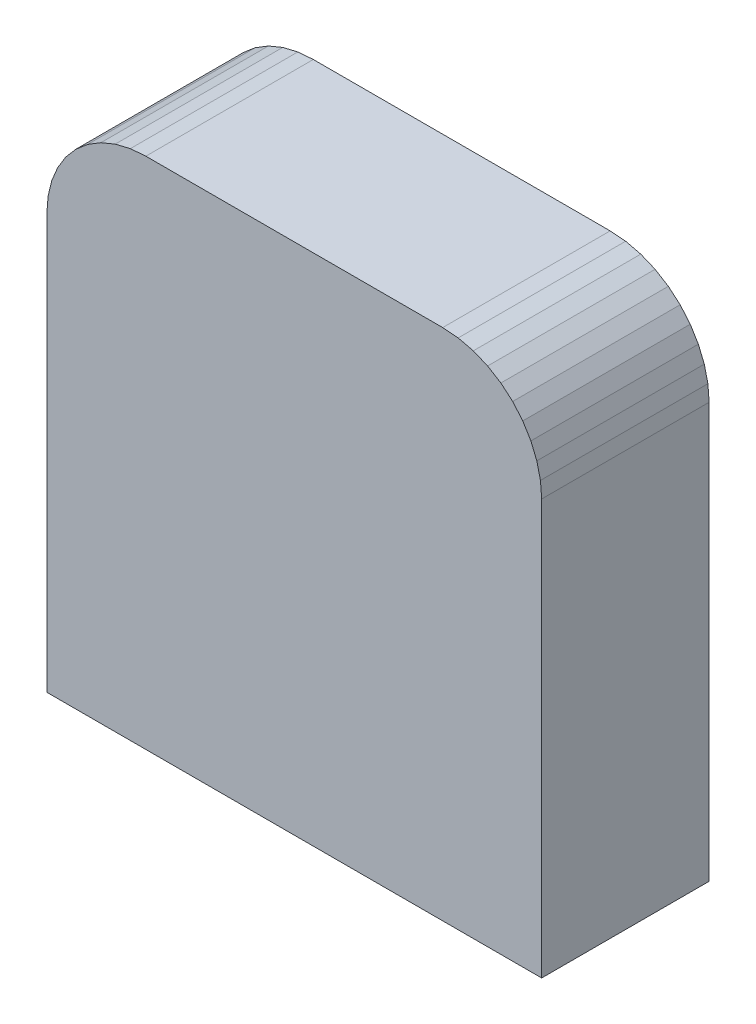
ISO-10303-21;
HEADER;
FILE_DESCRIPTION(('STEP AP214'),'2;1');
FILE_NAME('part.step','',(''),(''),'','','');
FILE_SCHEMA(('AUTOMOTIVE_DESIGN { 1 0 10303 214 1 1 1 1 }'));
ENDSEC;
DATA;
#1=APPLICATION_CONTEXT('core data for automotive mechanical design processes');
#2=APPLICATION_PROTOCOL_DEFINITION('international standard','automotive_design',2000,#1);
#3=PRODUCT_CONTEXT('',#1,'mechanical');
#4=PRODUCT('Part','Part','',(#3));
#5=PRODUCT_RELATED_PRODUCT_CATEGORY('part','',(#4));
#6=PRODUCT_DEFINITION_FORMATION('','',#4);
#7=PRODUCT_DEFINITION_CONTEXT('part definition',#1,'design');
#8=PRODUCT_DEFINITION('design','',#6,#7);
#9=PRODUCT_DEFINITION_SHAPE('','',#8);
#10=(LENGTH_UNIT() NAMED_UNIT(*) SI_UNIT(.MILLI.,.METRE.));
#11=(NAMED_UNIT(*) PLANE_ANGLE_UNIT() SI_UNIT($,.RADIAN.));
#12=(NAMED_UNIT(*) SI_UNIT($,.STERADIAN.) SOLID_ANGLE_UNIT());
#13=UNCERTAINTY_MEASURE_WITH_UNIT(LENGTH_MEASURE(1.E-05),#10,'distance_accuracy_value','');
#14=(GEOMETRIC_REPRESENTATION_CONTEXT(3) GLOBAL_UNCERTAINTY_ASSIGNED_CONTEXT((#13)) GLOBAL_UNIT_ASSIGNED_CONTEXT((#10,
#11,#12)) REPRESENTATION_CONTEXT('',''));
#15=CARTESIAN_POINT('',(0.,0.,0.));
#16=DIRECTION('',(0.,0.,1.));
#17=DIRECTION('',(1.,0.,0.));
#18=AXIS2_PLACEMENT_3D('',#15,#16,#17);
#19=CARTESIAN_POINT('',(2.04827694892883,22.9141213819385,5.69999957084656));
#20=DIRECTION('',(-0.76040506217341,0.649449106105362,0.));
#21=DIRECTION('',(-0.649449106105362,-0.76040506217341,0.));
#22=AXIS2_PLACEMENT_3D('',#19,#20,#21);
#23=PLANE('',#22);
#24=DIRECTION('',(0.,0.,1.));
#25=VECTOR('',#24,1.);
#26=CARTESIAN_POINT('',(2.18076019287109,23.0692388936877,5.69999957084656));
#27=LINE('',#26,#25);
#28=CARTESIAN_POINT('',(2.18076019287107,23.0692388936877,5.69999957084656));
#29=VERTEX_POINT('',#28);
#30=CARTESIAN_POINT('',(2.18076019287107,23.0692388936877,7.89999985694885));
#31=VERTEX_POINT('',#30);
#32=EDGE_CURVE('E181',#29,#31,#27,.T.);
#33=ORIENTED_EDGE('',*,*,#32,.F.);
#34=DIRECTION('',(-0.649449106105362,-0.76040506217341,0.));
#35=VECTOR('',#34,1.);
#36=CARTESIAN_POINT('',(2.04827694892883,22.9141213819385,5.69999957084656));
#37=LINE('',#36,#35);
#38=CARTESIAN_POINT('',(2.04827694892883,22.9141213819385,5.69999957084656));
#39=VERTEX_POINT('',#38);
#40=EDGE_CURVE('E174',#29,#39,#37,.T.);
#41=ORIENTED_EDGE('',*,*,#40,.T.);
#42=DIRECTION('',(0.,0.,1.));
#43=VECTOR('',#42,1.);
#44=CARTESIAN_POINT('',(2.04827694892884,22.9141213819385,5.69999957084656));
#45=LINE('',#44,#43);
#46=CARTESIAN_POINT('',(2.04827694892883,22.9141213819385,7.89999985694885));
#47=VERTEX_POINT('',#46);
#48=EDGE_CURVE('E184',#47,#39,#45,.F.);
#49=ORIENTED_EDGE('',*,*,#48,.F.);
#50=DIRECTION('',(-0.649449106105362,-0.76040506217341,0.));
#51=VECTOR('',#50,1.);
#52=CARTESIAN_POINT('',(2.04827694892883,22.9141213819385,7.89999985694885));
#53=LINE('',#52,#51);
#54=EDGE_CURVE('E19',#47,#31,#53,.F.);
#55=ORIENTED_EDGE('',*,*,#54,.T.);
#56=EDGE_LOOP('',(#33,#41,#49,#55));
#57=FACE_BOUND('',#56,.T.);
#58=ADVANCED_FACE('F16',(#57),#23,.T.);
#59=CARTESIAN_POINT('',(7.9192382723093,23.0692388936877,5.69999957084656));
#60=DIRECTION('',(0.760405107265921,0.649449053308959,0.));
#61=DIRECTION('',(-0.649449053308959,0.760405107265921,0.));
#62=AXIS2_PLACEMENT_3D('',#59,#60,#61);
#63=PLANE('',#62);
#64=DIRECTION('',(0.,0.,1.));
#65=VECTOR('',#64,1.);
#66=CARTESIAN_POINT('',(7.91923827230932,23.0692388936877,5.69999957084656));
#67=LINE('',#66,#65);
#68=CARTESIAN_POINT('',(7.91923827230931,23.0692388936877,7.89999985694885));
#69=VERTEX_POINT('',#68);
#70=CARTESIAN_POINT('',(7.91923827230931,23.0692388936877,5.69999957084656));
#71=VERTEX_POINT('',#70);
#72=EDGE_CURVE('E223',#69,#71,#67,.F.);
#73=ORIENTED_EDGE('',*,*,#72,.F.);
#74=DIRECTION('',(-0.649449053308959,0.760405107265921,0.));
#75=VECTOR('',#74,1.);
#76=CARTESIAN_POINT('',(7.9192382723093,23.0692388936877,7.89999985694885));
#77=LINE('',#76,#75);
#78=CARTESIAN_POINT('',(8.05172149762509,22.9141213819385,7.89999985694885));
#79=VERTEX_POINT('',#78);
#80=EDGE_CURVE('E198',#69,#79,#77,.F.);
#81=ORIENTED_EDGE('',*,*,#80,.T.);
#82=DIRECTION('',(0.,0.,1.));
#83=VECTOR('',#82,1.);
#84=CARTESIAN_POINT('',(8.05172149762511,22.9141213819385,5.69999957084656));
#85=LINE('',#84,#83);
#86=CARTESIAN_POINT('',(8.0517214976251,22.9141213819385,5.69999957084656));
#87=VERTEX_POINT('',#86);
#88=EDGE_CURVE('E245',#87,#79,#85,.T.);
#89=ORIENTED_EDGE('',*,*,#88,.F.);
#90=DIRECTION('',(-0.649449053308959,0.760405107265921,0.));
#91=VECTOR('',#90,1.);
#92=CARTESIAN_POINT('',(7.9192382723093,23.0692388936877,5.69999957084656));
#93=LINE('',#92,#91);
#94=EDGE_CURVE('E200',#87,#71,#93,.T.);
#95=ORIENTED_EDGE('',*,*,#94,.T.);
#96=EDGE_LOOP('',(#73,#81,#89,#95));
#97=FACE_BOUND('',#96,.T.);
#98=ADVANCED_FACE('F243',(#97),#63,.T.);
#99=CARTESIAN_POINT('',(2.18076019287109,23.0692388936877,5.69999957084656));
#100=DIRECTION('',(-0.649446220192815,0.760407526973047,0.));
#101=DIRECTION('',(-0.760407526973047,-0.649446220192815,0.));
#102=AXIS2_PLACEMENT_3D('',#99,#100,#101);
#103=PLANE('',#102);
#104=DIRECTION('',(0.,0.,1.));
#105=VECTOR('',#104,1.);
#106=CARTESIAN_POINT('',(2.33587889671326,23.20172213763,5.69999957084656));
#107=LINE('',#106,#105);
#108=CARTESIAN_POINT('',(2.33587889671327,23.20172213763,5.69999957084656));
#109=VERTEX_POINT('',#108);
#110=CARTESIAN_POINT('',(2.33587889671327,23.20172213763,7.89999985694885));
#111=VERTEX_POINT('',#110);
#112=EDGE_CURVE('E264',#109,#111,#107,.T.);
#113=ORIENTED_EDGE('',*,*,#112,.F.);
#114=DIRECTION('',(-0.760407526973047,-0.649446220192815,0.));
#115=VECTOR('',#114,1.);
#116=CARTESIAN_POINT('',(2.18076019287109,23.0692388936877,5.69999957084656));
#117=LINE('',#116,#115);
#118=EDGE_CURVE('E195',#109,#29,#117,.T.);
#119=ORIENTED_EDGE('',*,*,#118,.T.);
#120=ORIENTED_EDGE('',*,*,#32,.T.);
#121=DIRECTION('',(-0.760407526973047,-0.649446220192815,0.));
#122=VECTOR('',#121,1.);
#123=CARTESIAN_POINT('',(2.18076019287109,23.0692388936877,7.89999985694885));
#124=LINE('',#123,#122);
#125=EDGE_CURVE('E188',#31,#111,#124,.F.);
#126=ORIENTED_EDGE('',*,*,#125,.T.);
#127=EDGE_LOOP('',(#113,#119,#120,#126));
#128=FACE_BOUND('',#127,.T.);
#129=ADVANCED_FACE('F197',(#128),#103,.T.);
#130=CARTESIAN_POINT('',(7.7641202762723,23.20172213763,5.69999957084656));
#131=DIRECTION('',(0.649447933701424,0.760406063502225,0.));
#132=DIRECTION('',(-0.760406063502225,0.649447933701424,0.));
#133=AXIS2_PLACEMENT_3D('',#130,#131,#132);
#134=PLANE('',#133);
#135=ORIENTED_EDGE('',*,*,#72,.T.);
#136=DIRECTION('',(-0.760406063502225,0.649447933701424,0.));
#137=VECTOR('',#136,1.);
#138=CARTESIAN_POINT('',(7.7641202762723,23.20172213763,5.69999957084656));
#139=LINE('',#138,#137);
#140=CARTESIAN_POINT('',(7.76412027627229,23.20172213763,5.69999957084656));
#141=VERTEX_POINT('',#140);
#142=EDGE_CURVE('E218',#71,#141,#139,.T.);
#143=ORIENTED_EDGE('',*,*,#142,.T.);
#144=DIRECTION('',(0.,0.,1.));
#145=VECTOR('',#144,1.);
#146=CARTESIAN_POINT('',(7.76412027627228,23.20172213763,5.69999957084656));
#147=LINE('',#146,#145);
#148=CARTESIAN_POINT('',(7.76412027627229,23.20172213763,7.89999985694885));
#149=VERTEX_POINT('',#148);
#150=EDGE_CURVE('E233',#149,#141,#147,.F.);
#151=ORIENTED_EDGE('',*,*,#150,.F.);
#152=DIRECTION('',(-0.760406063502225,0.649447933701424,0.));
#153=VECTOR('',#152,1.);
#154=CARTESIAN_POINT('',(7.7641202762723,23.20172213763,7.89999985694885));
#155=LINE('',#154,#153);
#156=EDGE_CURVE('E226',#149,#69,#155,.F.);
#157=ORIENTED_EDGE('',*,*,#156,.T.);
#158=EDGE_LOOP('',(#135,#143,#151,#157));
#159=FACE_BOUND('',#158,.T.);
#160=ADVANCED_FACE('F230',(#159),#134,.T.);
#161=CARTESIAN_POINT('',(1.94169073104858,22.7401878759265,5.69999957084656));
#162=DIRECTION('',(-0.852640976084136,0.522497240090597,0.));
#163=DIRECTION('',(-0.522497240090597,-0.852640976084136,0.));
#164=AXIS2_PLACEMENT_3D('',#161,#162,#163);
#165=PLANE('',#164);
#166=ORIENTED_EDGE('',*,*,#48,.T.);
#167=DIRECTION('',(-0.522497240090597,-0.852640976084136,0.));
#168=VECTOR('',#167,1.);
#169=CARTESIAN_POINT('',(1.94169073104858,22.7401878759265,5.69999957084656));
#170=LINE('',#169,#168);
#171=CARTESIAN_POINT('',(1.94169073104859,22.7401878759265,5.69999957084656));
#172=VERTEX_POINT('',#171);
#173=EDGE_CURVE('E205',#39,#172,#170,.T.);
#174=ORIENTED_EDGE('',*,*,#173,.T.);
#175=DIRECTION('',(0.,0.,1.));
#176=VECTOR('',#175,1.);
#177=CARTESIAN_POINT('',(1.9416907310486,22.7401878759265,5.69999957084656));
#178=LINE('',#177,#176);
#179=CARTESIAN_POINT('',(1.94169073104859,22.7401878759265,7.89999985694885));
#180=VERTEX_POINT('',#179);
#181=EDGE_CURVE('E320',#180,#172,#178,.F.);
#182=ORIENTED_EDGE('',*,*,#181,.F.);
#183=DIRECTION('',(-0.522497240090597,-0.852640976084136,0.));
#184=VECTOR('',#183,1.);
#185=CARTESIAN_POINT('',(1.94169073104858,22.7401878759265,7.89999985694885));
#186=LINE('',#185,#184);
#187=EDGE_CURVE('E216',#180,#47,#186,.F.);
#188=ORIENTED_EDGE('',*,*,#187,.T.);
#189=EDGE_LOOP('',(#166,#174,#182,#188));
#190=FACE_BOUND('',#189,.T.);
#191=ADVANCED_FACE('F215',(#190),#165,.T.);
#192=CARTESIAN_POINT('',(8.05172149762511,22.9141213819385,5.69999957084656));
#193=DIRECTION('',(0.852640650657335,0.522497771140353,0.));
#194=DIRECTION('',(-0.522497771140353,0.852640650657335,0.));
#195=AXIS2_PLACEMENT_3D('',#192,#193,#194);
#196=PLANE('',#195);
#197=ORIENTED_EDGE('',*,*,#88,.T.);
#198=DIRECTION('',(-0.522497771140353,0.852640650657335,0.));
#199=VECTOR('',#198,1.);
#200=CARTESIAN_POINT('',(8.05172149762511,22.9141213819385,7.89999985694885));
#201=LINE('',#200,#199);
#202=CARTESIAN_POINT('',(8.15830786451698,22.7401878759265,7.89999985694885));
#203=VERTEX_POINT('',#202);
#204=EDGE_CURVE('E239',#79,#203,#201,.F.);
#205=ORIENTED_EDGE('',*,*,#204,.T.);
#206=DIRECTION('',(0.,0.,1.));
#207=VECTOR('',#206,1.);
#208=CARTESIAN_POINT('',(8.15830786451697,22.7401878759265,5.69999957084656));
#209=LINE('',#208,#207);
#210=CARTESIAN_POINT('',(8.15830786451698,22.7401878759265,5.69999957084656));
#211=VERTEX_POINT('',#210);
#212=EDGE_CURVE('E271',#211,#203,#209,.T.);
#213=ORIENTED_EDGE('',*,*,#212,.F.);
#214=DIRECTION('',(-0.522497771140353,0.852640650657335,0.));
#215=VECTOR('',#214,1.);
#216=CARTESIAN_POINT('',(8.05172149762511,22.9141213819385,5.69999957084656));
#217=LINE('',#216,#215);
#218=EDGE_CURVE('E213',#211,#87,#217,.T.);
#219=ORIENTED_EDGE('',*,*,#218,.T.);
#220=EDGE_LOOP('',(#197,#205,#213,#219));
#221=FACE_BOUND('',#220,.T.);
#222=ADVANCED_FACE('F269',(#221),#196,.T.);
#223=CARTESIAN_POINT('',(2.33587889671326,23.20172213763,5.69999957084656));
#224=DIRECTION('',(-0.522498541800272,0.852640178396837,0.));
#225=DIRECTION('',(-0.852640178396837,-0.522498541800272,0.));
#226=AXIS2_PLACEMENT_3D('',#223,#224,#225);
#227=PLANE('',#226);
#228=DIRECTION('',(0.,0.,1.));
#229=VECTOR('',#228,1.);
#230=CARTESIAN_POINT('',(2.50981180667877,23.3083083555102,5.69999957084656));
#231=LINE('',#230,#229);
#232=CARTESIAN_POINT('',(2.50981180667876,23.3083083555102,5.69999957084656));
#233=VERTEX_POINT('',#232);
#234=CARTESIAN_POINT('',(2.50981180667876,23.3083083555102,7.89999985694885));
#235=VERTEX_POINT('',#234);
#236=EDGE_CURVE('E311',#233,#235,#231,.T.);
#237=ORIENTED_EDGE('',*,*,#236,.F.);
#238=DIRECTION('',(-0.852640178396837,-0.522498541800272,0.));
#239=VECTOR('',#238,1.);
#240=CARTESIAN_POINT('',(2.33587889671326,23.20172213763,5.69999957084656));
#241=LINE('',#240,#239);
#242=EDGE_CURVE('E257',#233,#109,#241,.T.);
#243=ORIENTED_EDGE('',*,*,#242,.T.);
#244=ORIENTED_EDGE('',*,*,#112,.T.);
#245=DIRECTION('',(-0.852640178396837,-0.522498541800272,0.));
#246=VECTOR('',#245,1.);
#247=CARTESIAN_POINT('',(2.33587889671326,23.20172213763,7.89999985694885));
#248=LINE('',#247,#246);
#249=EDGE_CURVE('E191',#111,#235,#248,.F.);
#250=ORIENTED_EDGE('',*,*,#249,.T.);
#251=EDGE_LOOP('',(#237,#243,#244,#250));
#252=FACE_BOUND('',#251,.T.);
#253=ADVANCED_FACE('F584',(#252),#227,.T.);
#254=CARTESIAN_POINT('',(7.59018710553646,23.3083083555102,5.69999957084656));
#255=DIRECTION('',(0.522497972301641,0.852640527385764,0.));
#256=DIRECTION('',(-0.852640527385764,0.522497972301641,0.));
#257=AXIS2_PLACEMENT_3D('',#254,#255,#256);
#258=PLANE('',#257);
#259=ORIENTED_EDGE('',*,*,#150,.T.);
#260=DIRECTION('',(-0.852640527385764,0.522497972301641,0.));
#261=VECTOR('',#260,1.);
#262=CARTESIAN_POINT('',(7.59018710553646,23.3083083555102,5.69999957084656));
#263=LINE('',#262,#261);
#264=CARTESIAN_POINT('',(7.59018710553647,23.3083083555102,5.69999957084656));
#265=VERTEX_POINT('',#264);
#266=EDGE_CURVE('E248',#141,#265,#263,.T.);
#267=ORIENTED_EDGE('',*,*,#266,.T.);
#268=DIRECTION('',(0.,0.,1.));
#269=VECTOR('',#268,1.);
#270=CARTESIAN_POINT('',(7.59018710553648,23.3083083555103,5.69999957084656));
#271=LINE('',#270,#269);
#272=CARTESIAN_POINT('',(7.59018710553647,23.3083083555102,7.89999985694885));
#273=VERTEX_POINT('',#272);
#274=EDGE_CURVE('E307',#273,#265,#271,.F.);
#275=ORIENTED_EDGE('',*,*,#274,.F.);
#276=DIRECTION('',(-0.852640527385764,0.522497972301641,0.));
#277=VECTOR('',#276,1.);
#278=CARTESIAN_POINT('',(7.59018710553646,23.3083083555102,7.89999985694885));
#279=LINE('',#278,#277);
#280=EDGE_CURVE('E235',#273,#149,#279,.F.);
#281=ORIENTED_EDGE('',*,*,#280,.T.);
#282=EDGE_LOOP('',(#259,#267,#275,#281));
#283=FACE_BOUND('',#282,.T.);
#284=ADVANCED_FACE('F255',(#283),#258,.T.);
#285=CARTESIAN_POINT('',(1.86362593173981,22.5517221614718,5.69999957084656));
#286=DIRECTION('',(-0.923879975611061,0.382682362625853,0.));
#287=DIRECTION('',(-0.382682362625853,-0.923879975611061,0.));
#288=AXIS2_PLACEMENT_3D('',#285,#286,#287);
#289=PLANE('',#288);
#290=ORIENTED_EDGE('',*,*,#181,.T.);
#291=DIRECTION('',(-0.382682362625853,-0.923879975611061,0.));
#292=VECTOR('',#291,1.);
#293=CARTESIAN_POINT('',(1.86362593173981,22.5517221614718,5.69999957084656));
#294=LINE('',#293,#292);
#295=CARTESIAN_POINT('',(1.86362593173981,22.5517221614718,5.69999957084656));
#296=VERTEX_POINT('',#295);
#297=EDGE_CURVE('E209',#172,#296,#294,.T.);
#298=ORIENTED_EDGE('',*,*,#297,.T.);
#299=DIRECTION('',(0.,0.,1.));
#300=VECTOR('',#299,1.);
#301=CARTESIAN_POINT('',(1.8636259317398,22.5517221614718,5.69999957084656));
#302=LINE('',#301,#300);
#303=CARTESIAN_POINT('',(1.86362593173981,22.5517221614718,7.89999985694885));
#304=VERTEX_POINT('',#303);
#305=EDGE_CURVE('E294',#304,#296,#302,.F.);
#306=ORIENTED_EDGE('',*,*,#305,.F.);
#307=DIRECTION('',(-0.382682362625853,-0.923879975611061,0.));
#308=VECTOR('',#307,1.);
#309=CARTESIAN_POINT('',(1.86362593173981,22.5517221614718,7.89999985694885));
#310=LINE('',#309,#308);
#311=EDGE_CURVE('E253',#304,#180,#310,.F.);
#312=ORIENTED_EDGE('',*,*,#311,.T.);
#313=EDGE_LOOP('',(#290,#298,#306,#312));
#314=FACE_BOUND('',#313,.T.);
#315=ADVANCED_FACE('F324',(#314),#289,.T.);
#316=CARTESIAN_POINT('',(8.15830786451697,22.7401878759265,5.69999957084656));
#317=DIRECTION('',(0.923879451019666,0.382683629103207,0.));
#318=DIRECTION('',(-0.382683629103207,0.923879451019666,0.));
#319=AXIS2_PLACEMENT_3D('',#316,#317,#318);
#320=PLANE('',#319);
#321=ORIENTED_EDGE('',*,*,#212,.T.);
#322=DIRECTION('',(-0.382683629103207,0.923879451019666,0.));
#323=VECTOR('',#322,1.);
#324=CARTESIAN_POINT('',(8.15830786451697,22.7401878759265,7.89999985694885));
#325=LINE('',#324,#323);
#326=CARTESIAN_POINT('',(8.2363729665056,22.5517221614718,7.89999985694885));
#327=VERTEX_POINT('',#326);
#328=EDGE_CURVE('E283',#203,#327,#325,.F.);
#329=ORIENTED_EDGE('',*,*,#328,.T.);
#330=DIRECTION('',(0.,0.,1.));
#331=VECTOR('',#330,1.);
#332=CARTESIAN_POINT('',(8.23637296650559,22.5517221614718,5.69999957084656));
#333=LINE('',#332,#331);
#334=CARTESIAN_POINT('',(8.23637296650559,22.5517221614718,5.69999957084656));
#335=VERTEX_POINT('',#334);
#336=EDGE_CURVE('E281',#335,#327,#333,.T.);
#337=ORIENTED_EDGE('',*,*,#336,.F.);
#338=DIRECTION('',(-0.382683629103207,0.923879451019666,0.));
#339=VECTOR('',#338,1.);
#340=CARTESIAN_POINT('',(8.15830786451697,22.7401878759265,5.69999957084656));
#341=LINE('',#340,#339);
#342=EDGE_CURVE('E273',#335,#211,#341,.T.);
#343=ORIENTED_EDGE('',*,*,#342,.T.);
#344=EDGE_LOOP('',(#321,#329,#337,#343));
#345=FACE_BOUND('',#344,.T.);
#346=ADVANCED_FACE('F282',(#345),#320,.T.);
#347=CARTESIAN_POINT('',(2.50981180667877,23.3083083555102,5.69999957084656));
#348=DIRECTION('',(-0.382684856609969,0.923878942568456,0.));
#349=DIRECTION('',(-0.923878942568456,-0.382684856609969,0.));
#350=AXIS2_PLACEMENT_3D('',#347,#348,#349);
#351=PLANE('',#350);
#352=ORIENTED_EDGE('',*,*,#236,.T.);
#353=DIRECTION('',(-0.923878942568456,-0.382684856609969,0.));
#354=VECTOR('',#353,1.);
#355=CARTESIAN_POINT('',(2.50981180667877,23.3083083555102,7.89999985694885));
#356=LINE('',#355,#354);
#357=CARTESIAN_POINT('',(2.69827752113343,23.3863737508655,7.89999985694885));
#358=VERTEX_POINT('',#357);
#359=EDGE_CURVE('E309',#235,#358,#356,.F.);
#360=ORIENTED_EDGE('',*,*,#359,.T.);
#361=DIRECTION('',(0.,0.,1.));
#362=VECTOR('',#361,1.);
#363=CARTESIAN_POINT('',(2.69827752113342,23.3863737508655,5.69999957084656));
#364=LINE('',#363,#362);
#365=CARTESIAN_POINT('',(2.69827752113343,23.3863737508655,5.69999957084656));
#366=VERTEX_POINT('',#365);
#367=EDGE_CURVE('E352',#366,#358,#364,.T.);
#368=ORIENTED_EDGE('',*,*,#367,.F.);
#369=DIRECTION('',(-0.923878942568456,-0.382684856609969,0.));
#370=VECTOR('',#369,1.);
#371=CARTESIAN_POINT('',(2.50981180667877,23.3083083555102,5.69999957084656));
#372=LINE('',#371,#370);
#373=EDGE_CURVE('E314',#366,#233,#372,.T.);
#374=ORIENTED_EDGE('',*,*,#373,.T.);
#375=EDGE_LOOP('',(#352,#360,#368,#374));
#376=FACE_BOUND('',#375,.T.);
#377=ADVANCED_FACE('F553',(#376),#351,.T.);
#378=CARTESIAN_POINT('',(7.40172146558761,23.3863737508655,5.69999957084656));
#379=DIRECTION('',(0.38268498574061,0.923878889080549,0.));
#380=DIRECTION('',(-0.923878889080549,0.38268498574061,0.));
#381=AXIS2_PLACEMENT_3D('',#378,#379,#380);
#382=PLANE('',#381);
#383=DIRECTION('',(0.,0.,1.));
#384=VECTOR('',#383,1.);
#385=CARTESIAN_POINT('',(7.40172146558761,23.3863737508655,5.69999957084656));
#386=LINE('',#385,#384);
#387=CARTESIAN_POINT('',(7.40172146558761,23.3863737508655,7.89999985694885));
#388=VERTEX_POINT('',#387);
#389=CARTESIAN_POINT('',(7.40172146558761,23.3863737508655,5.69999957084656));
#390=VERTEX_POINT('',#389);
#391=EDGE_CURVE('E341',#388,#390,#386,.F.);
#392=ORIENTED_EDGE('',*,*,#391,.F.);
#393=DIRECTION('',(-0.923878889080549,0.38268498574061,0.));
#394=VECTOR('',#393,1.);
#395=CARTESIAN_POINT('',(7.40172146558761,23.3863737508655,7.89999985694885));
#396=LINE('',#395,#394);
#397=EDGE_CURVE('E303',#388,#273,#396,.F.);
#398=ORIENTED_EDGE('',*,*,#397,.T.);
#399=ORIENTED_EDGE('',*,*,#274,.T.);
#400=DIRECTION('',(-0.923878889080549,0.38268498574061,0.));
#401=VECTOR('',#400,1.);
#402=CARTESIAN_POINT('',(7.40172146558761,23.3863737508655,5.69999957084656));
#403=LINE('',#402,#401);
#404=EDGE_CURVE('E250',#265,#390,#403,.T.);
#405=ORIENTED_EDGE('',*,*,#404,.T.);
#406=EDGE_LOOP('',(#392,#398,#399,#405));
#407=FACE_BOUND('',#406,.T.);
#408=ADVANCED_FACE('F545',(#407),#382,.T.);
#409=CARTESIAN_POINT('',(1.81600480079651,22.3533650562167,5.69999957084656));
#410=DIRECTION('',(-0.972370139322403,0.233444451966908,0.));
#411=DIRECTION('',(-0.233444451966908,-0.972370139322403,0.));
#412=AXIS2_PLACEMENT_3D('',#409,#410,#411);
#413=PLANE('',#412);
#414=ORIENTED_EDGE('',*,*,#305,.T.);
#415=DIRECTION('',(-0.233444451966908,-0.972370139322403,0.));
#416=VECTOR('',#415,1.);
#417=CARTESIAN_POINT('',(1.81600480079651,22.3533650562167,5.69999957084656));
#418=LINE('',#417,#416);
#419=CARTESIAN_POINT('',(1.81600480079651,22.3533650562167,5.69999957084656));
#420=VERTEX_POINT('',#419);
#421=EDGE_CURVE('E292',#296,#420,#418,.T.);
#422=ORIENTED_EDGE('',*,*,#421,.T.);
#423=DIRECTION('',(0.,0.,1.));
#424=VECTOR('',#423,1.);
#425=CARTESIAN_POINT('',(1.8160048007965,22.3533650562167,5.69999957084656));
#426=LINE('',#425,#424);
#427=CARTESIAN_POINT('',(1.81600480079651,22.3533650562167,7.89999985694885));
#428=VERTEX_POINT('',#427);
#429=EDGE_CURVE('E332',#428,#420,#426,.F.);
#430=ORIENTED_EDGE('',*,*,#429,.F.);
#431=DIRECTION('',(-0.233444451966908,-0.972370139322403,0.));
#432=VECTOR('',#431,1.);
#433=CARTESIAN_POINT('',(1.81600480079651,22.3533650562167,7.89999985694885));
#434=LINE('',#433,#432);
#435=EDGE_CURVE('E300',#428,#304,#434,.F.);
#436=ORIENTED_EDGE('',*,*,#435,.T.);
#437=EDGE_LOOP('',(#414,#422,#430,#436));
#438=FACE_BOUND('',#437,.T.);
#439=ADVANCED_FACE('F333',(#438),#413,.T.);
#440=CARTESIAN_POINT('',(8.23637296650559,22.5517221614718,5.69999957084656));
#441=DIRECTION('',(0.972369937237228,0.233445293714117,0.));
#442=DIRECTION('',(-0.233445293714117,0.972369937237228,0.));
#443=AXIS2_PLACEMENT_3D('',#440,#441,#442);
#444=PLANE('',#443);
#445=ORIENTED_EDGE('',*,*,#336,.T.);
#446=DIRECTION('',(-0.233445293714117,0.972369937237228,0.));
#447=VECTOR('',#446,1.);
#448=CARTESIAN_POINT('',(8.23637296650559,22.5517221614718,7.89999985694885));
#449=LINE('',#448,#447);
#450=CARTESIAN_POINT('',(8.28399427905679,22.3533650562167,7.89999985694885));
#451=VERTEX_POINT('',#450);
#452=EDGE_CURVE('E286',#327,#451,#449,.F.);
#453=ORIENTED_EDGE('',*,*,#452,.T.);
#454=DIRECTION('',(0.,0.,1.));
#455=VECTOR('',#454,1.);
#456=CARTESIAN_POINT('',(8.28399427905679,22.3533650562167,5.69999957084656));
#457=LINE('',#456,#455);
#458=CARTESIAN_POINT('',(8.28399427905679,22.3533650562167,5.69999957084656));
#459=VERTEX_POINT('',#458);
#460=EDGE_CURVE('E290',#459,#451,#457,.T.);
#461=ORIENTED_EDGE('',*,*,#460,.F.);
#462=DIRECTION('',(-0.233445293714117,0.972369937237228,0.));
#463=VECTOR('',#462,1.);
#464=CARTESIAN_POINT('',(8.23637296650559,22.5517221614718,5.69999957084656));
#465=LINE('',#464,#463);
#466=EDGE_CURVE('E276',#459,#335,#465,.T.);
#467=ORIENTED_EDGE('',*,*,#466,.T.);
#468=EDGE_LOOP('',(#445,#453,#461,#467));
#469=FACE_BOUND('',#468,.T.);
#470=ADVANCED_FACE('F288',(#469),#444,.T.);
#471=CARTESIAN_POINT('',(2.69827752113342,23.3863737508655,5.69999957084656));
#472=DIRECTION('',(-0.233444451966908,0.972370139322403,0.));
#473=DIRECTION('',(-0.972370139322403,-0.233444451966908,0.));
#474=AXIS2_PLACEMENT_3D('',#471,#472,#473);
#475=PLANE('',#474);
#476=ORIENTED_EDGE('',*,*,#367,.T.);
#477=DIRECTION('',(-0.972370139322403,-0.233444451966908,0.));
#478=VECTOR('',#477,1.);
#479=CARTESIAN_POINT('',(2.69827752113342,23.3863737508655,7.89999985694885));
#480=LINE('',#479,#478);
#481=CARTESIAN_POINT('',(2.89663462638855,23.4339948818088,7.89999985694885));
#482=VERTEX_POINT('',#481);
#483=EDGE_CURVE('E350',#358,#482,#480,.F.);
#484=ORIENTED_EDGE('',*,*,#483,.T.);
#485=DIRECTION('',(0.,0.,1.));
#486=VECTOR('',#485,1.);
#487=CARTESIAN_POINT('',(2.89663462638855,23.4339948818088,5.69999957084656));
#488=LINE('',#487,#486);
#489=CARTESIAN_POINT('',(2.89663462638855,23.4339948818088,5.69999957084656));
#490=VERTEX_POINT('',#489);
#491=EDGE_CURVE('E376',#490,#482,#488,.T.);
#492=ORIENTED_EDGE('',*,*,#491,.F.);
#493=DIRECTION('',(0.972370139322404,0.233444451966907,0.));
#494=VECTOR('',#493,1.);
#495=CARTESIAN_POINT('',(2.69827752113342,23.3863737508655,5.69999957084656));
#496=LINE('',#495,#494);
#497=EDGE_CURVE('E369',#366,#490,#496,.T.);
#498=ORIENTED_EDGE('',*,*,#497,.F.);
#499=EDGE_LOOP('',(#476,#484,#492,#498));
#500=FACE_BOUND('',#499,.T.);
#501=ADVANCED_FACE('F521',(#500),#475,.T.);
#502=CARTESIAN_POINT('',(7.20336421132088,23.4339948818088,5.69999957084656));
#503=DIRECTION('',(0.233444286153809,0.972370179130427,0.));
#504=DIRECTION('',(-0.972370179130427,0.233444286153809,0.));
#505=AXIS2_PLACEMENT_3D('',#502,#503,#504);
#506=PLANE('',#505);
#507=ORIENTED_EDGE('',*,*,#391,.T.);
#508=DIRECTION('',(0.972370179130424,-0.233444286153822,0.));
#509=VECTOR('',#508,1.);
#510=CARTESIAN_POINT('',(7.20336421132088,23.4339948818088,5.69999957084656));
#511=LINE('',#510,#509);
#512=CARTESIAN_POINT('',(7.20336421132088,23.4339948818088,5.69999957084656));
#513=VERTEX_POINT('',#512);
#514=EDGE_CURVE('E371',#513,#390,#511,.T.);
#515=ORIENTED_EDGE('',*,*,#514,.F.);
#516=DIRECTION('',(0.,0.,1.));
#517=VECTOR('',#516,1.);
#518=CARTESIAN_POINT('',(7.20336421132088,23.4339948818088,5.69999957084656));
#519=LINE('',#518,#517);
#520=CARTESIAN_POINT('',(7.20336421132088,23.4339948818088,7.89999985694885));
#521=VERTEX_POINT('',#520);
#522=EDGE_CURVE('E382',#521,#513,#519,.F.);
#523=ORIENTED_EDGE('',*,*,#522,.F.);
#524=DIRECTION('',(-0.972370179130427,0.233444286153809,0.));
#525=VECTOR('',#524,1.);
#526=CARTESIAN_POINT('',(7.20336421132088,23.4339948818088,7.89999985694885));
#527=LINE('',#526,#525);
#528=EDGE_CURVE('E344',#521,#388,#527,.F.);
#529=ORIENTED_EDGE('',*,*,#528,.T.);
#530=EDGE_LOOP('',(#507,#515,#523,#529));
#531=FACE_BOUND('',#530,.T.);
#532=ADVANCED_FACE('F513',(#531),#506,.T.);
#533=CARTESIAN_POINT('',(1.79999976158142,22.1499999687076,5.69999957084656));
#534=DIRECTION('',(-0.996917387520508,0.0784584122913937,0.));
#535=DIRECTION('',(-0.0784584122913937,-0.996917387520508,0.));
#536=AXIS2_PLACEMENT_3D('',#533,#534,#535);
#537=PLANE('',#536);
#538=ORIENTED_EDGE('',*,*,#429,.T.);
#539=DIRECTION('',(0.0784584122914256,0.996917387520505,0.));
#540=VECTOR('',#539,1.);
#541=CARTESIAN_POINT('',(1.79999976158142,22.1499999687076,5.69999957084656));
#542=LINE('',#541,#540);
#543=CARTESIAN_POINT('',(1.79999976158142,22.1499999687076,5.69999957084656));
#544=VERTEX_POINT('',#543);
#545=EDGE_CURVE('E367',#544,#420,#542,.T.);
#546=ORIENTED_EDGE('',*,*,#545,.F.);
#547=DIRECTION('',(0.,0.,1.));
#548=VECTOR('',#547,1.);
#549=CARTESIAN_POINT('',(1.79999976158142,22.1499999687076,5.69999957084656));
#550=LINE('',#549,#548);
#551=CARTESIAN_POINT('',(1.79999976158142,22.1499999687076,7.89999985694885));
#552=VERTEX_POINT('',#551);
#553=EDGE_CURVE('E339',#552,#544,#550,.F.);
#554=ORIENTED_EDGE('',*,*,#553,.F.);
#555=DIRECTION('',(-0.0784584122913937,-0.996917387520508,0.));
#556=VECTOR('',#555,1.);
#557=CARTESIAN_POINT('',(1.79999976158142,22.1499999687076,7.89999985694885));
#558=LINE('',#557,#556);
#559=EDGE_CURVE('E328',#552,#428,#558,.F.);
#560=ORIENTED_EDGE('',*,*,#559,.T.);
#561=EDGE_LOOP('',(#538,#546,#554,#560));
#562=FACE_BOUND('',#561,.T.);
#563=ADVANCED_FACE('F337',(#562),#537,.T.);
#564=CARTESIAN_POINT('',(8.28399427905679,22.3533650562167,5.69999957084656));
#565=DIRECTION('',(0.996917308959508,0.0784594105058933,0.));
#566=DIRECTION('',(-0.0784594105058933,0.996917308959508,0.));
#567=AXIS2_PLACEMENT_3D('',#564,#565,#566);
#568=PLANE('',#567);
#569=ORIENTED_EDGE('',*,*,#460,.T.);
#570=DIRECTION('',(-0.0784594105058933,0.996917308959508,0.));
#571=VECTOR('',#570,1.);
#572=CARTESIAN_POINT('',(8.28399427905679,22.3533650562167,7.89999985694885));
#573=LINE('',#572,#571);
#574=CARTESIAN_POINT('',(8.29999952316284,22.1499999687076,7.89999985694885));
#575=VERTEX_POINT('',#574);
#576=EDGE_CURVE('E356',#451,#575,#573,.F.);
#577=ORIENTED_EDGE('',*,*,#576,.T.);
#578=DIRECTION('',(0.,0.,1.));
#579=VECTOR('',#578,1.);
#580=CARTESIAN_POINT('',(8.29999952316284,22.1499999687076,5.69999957084656));
#581=LINE('',#580,#579);
#582=CARTESIAN_POINT('',(8.29999952316284,22.1499999687076,5.69999957084656));
#583=VERTEX_POINT('',#582);
#584=EDGE_CURVE('E400',#583,#575,#581,.T.);
#585=ORIENTED_EDGE('',*,*,#584,.F.);
#586=DIRECTION('',(0.0784594105058898,-0.996917308959508,0.));
#587=VECTOR('',#586,1.);
#588=CARTESIAN_POINT('',(8.28399427905679,22.3533650562167,5.69999957084656));
#589=LINE('',#588,#587);
#590=EDGE_CURVE('E362',#459,#583,#589,.T.);
#591=ORIENTED_EDGE('',*,*,#590,.F.);
#592=EDGE_LOOP('',(#569,#577,#585,#591));
#593=FACE_BOUND('',#592,.T.);
#594=ADVANCED_FACE('F364',(#593),#568,.T.);
#595=CARTESIAN_POINT('',(7.40172146558761,23.3863737508655,5.69999957084656));
#596=DIRECTION('',(0.,0.,-1.));
#597=DIRECTION('',(0.,1.,0.));
#598=AXIS2_PLACEMENT_3D('',#595,#596,#597);
#599=PLANE('',#598);
#600=ORIENTED_EDGE('',*,*,#404,.F.);
#601=ORIENTED_EDGE('',*,*,#266,.F.);
#602=ORIENTED_EDGE('',*,*,#142,.F.);
#603=ORIENTED_EDGE('',*,*,#94,.F.);
#604=ORIENTED_EDGE('',*,*,#218,.F.);
#605=ORIENTED_EDGE('',*,*,#342,.F.);
#606=ORIENTED_EDGE('',*,*,#466,.F.);
#607=ORIENTED_EDGE('',*,*,#590,.T.);
#608=DIRECTION('',(0.,1.,0.));
#609=VECTOR('',#608,1.);
#610=CARTESIAN_POINT('',(8.29999952316284,16.7000000439584,5.69999957084656));
#611=LINE('',#610,#609);
#612=CARTESIAN_POINT('',(8.29999952316284,16.7000000439584,5.69999957084656));
#613=VERTEX_POINT('',#612);
#614=EDGE_CURVE('E397',#613,#583,#611,.T.);
#615=ORIENTED_EDGE('',*,*,#614,.F.);
#616=DIRECTION('',(1.,0.,0.));
#617=VECTOR('',#616,1.);
#618=CARTESIAN_POINT('',(1.79999976158142,16.7000000439584,5.69999957084656));
#619=LINE('',#618,#617);
#620=CARTESIAN_POINT('',(1.79999976158142,16.7000000439584,5.69999957084656));
#621=VERTEX_POINT('',#620);
#622=EDGE_CURVE('E394',#621,#613,#619,.T.);
#623=ORIENTED_EDGE('',*,*,#622,.F.);
#624=DIRECTION('',(0.,-1.,0.));
#625=VECTOR('',#624,1.);
#626=CARTESIAN_POINT('',(1.79999976158142,22.1499999687076,5.69999957084656));
#627=LINE('',#626,#625);
#628=EDGE_CURVE('E388',#544,#621,#627,.T.);
#629=ORIENTED_EDGE('',*,*,#628,.F.);
#630=ORIENTED_EDGE('',*,*,#545,.T.);
#631=ORIENTED_EDGE('',*,*,#421,.F.);
#632=ORIENTED_EDGE('',*,*,#297,.F.);
#633=ORIENTED_EDGE('',*,*,#173,.F.);
#634=ORIENTED_EDGE('',*,*,#40,.F.);
#635=ORIENTED_EDGE('',*,*,#118,.F.);
#636=ORIENTED_EDGE('',*,*,#242,.F.);
#637=ORIENTED_EDGE('',*,*,#373,.F.);
#638=ORIENTED_EDGE('',*,*,#497,.T.);
#639=DIRECTION('',(-0.996917158976678,-0.0784613161874638,0.));
#640=VECTOR('',#639,1.);
#641=CARTESIAN_POINT('',(2.89663462638855,23.4339948818088,5.69999957084656));
#642=LINE('',#641,#640);
#643=CARTESIAN_POINT('',(3.09999971389772,23.4500005170703,5.69999957084656));
#644=VERTEX_POINT('',#643);
#645=EDGE_CURVE('E373',#644,#490,#642,.T.);
#646=ORIENTED_EDGE('',*,*,#645,.F.);
#647=DIRECTION('',(1.,0.,0.));
#648=VECTOR('',#647,1.);
#649=CARTESIAN_POINT('',(6.99999942183494,23.4500005170703,5.69999957084656));
#650=LINE('',#649,#648);
#651=CARTESIAN_POINT('',(6.99999942183494,23.4500005170703,5.69999957084656));
#652=VERTEX_POINT('',#651);
#653=EDGE_CURVE('E405',#652,#644,#650,.F.);
#654=ORIENTED_EDGE('',*,*,#653,.F.);
#655=DIRECTION('',(-0.996917149982843,0.0784614304616327,0.));
#656=VECTOR('',#655,1.);
#657=CARTESIAN_POINT('',(6.99999942183494,23.4500005170703,5.69999957084656));
#658=LINE('',#657,#656);
#659=EDGE_CURVE('E385',#513,#652,#658,.T.);
#660=ORIENTED_EDGE('',*,*,#659,.F.);
#661=ORIENTED_EDGE('',*,*,#514,.T.);
#662=EDGE_LOOP('',(#600,#601,#602,#603,#604,#605,#606,#607,#615,#623,#629,#630,#631,#632,#633,
#634,#635,#636,#637,#638,#646,#654,#660,#661));
#663=FACE_BOUND('',#662,.T.);
#664=ADVANCED_FACE('F207',(#663),#599,.T.);
#665=CARTESIAN_POINT('',(2.89663462638855,23.4339948818088,5.69999957084656));
#666=DIRECTION('',(-0.0784613161874638,0.996917158976678,0.));
#667=DIRECTION('',(-0.996917158976678,-0.0784613161874638,0.));
#668=AXIS2_PLACEMENT_3D('',#665,#666,#667);
#669=PLANE('',#668);
#670=ORIENTED_EDGE('',*,*,#491,.T.);
#671=DIRECTION('',(-0.996917158976678,-0.0784613161874638,0.));
#672=VECTOR('',#671,1.);
#673=CARTESIAN_POINT('',(2.89663462638855,23.4339948818088,7.89999985694885));
#674=LINE('',#673,#672);
#675=CARTESIAN_POINT('',(3.0999997138977,23.4500005170703,7.89999985694885));
#676=VERTEX_POINT('',#675);
#677=EDGE_CURVE('E34',#482,#676,#674,.F.);
#678=ORIENTED_EDGE('',*,*,#677,.T.);
#679=DIRECTION('',(0.,0.,1.));
#680=VECTOR('',#679,1.);
#681=CARTESIAN_POINT('',(3.0999997138977,23.4500005170703,5.69999957084656));
#682=LINE('',#681,#680);
#683=EDGE_CURVE('E408',#644,#676,#682,.T.);
#684=ORIENTED_EDGE('',*,*,#683,.F.);
#685=ORIENTED_EDGE('',*,*,#645,.T.);
#686=EDGE_LOOP('',(#670,#678,#684,#685));
#687=FACE_BOUND('',#686,.T.);
#688=ADVANCED_FACE('F435',(#687),#669,.T.);
#689=CARTESIAN_POINT('',(6.99999942183494,23.4500005170703,5.69999957084656));
#690=DIRECTION('',(0.0784614304616327,0.996917149982843,0.));
#691=DIRECTION('',(-0.996917149982843,0.0784614304616327,0.));
#692=AXIS2_PLACEMENT_3D('',#689,#690,#691);
#693=PLANE('',#692);
#694=ORIENTED_EDGE('',*,*,#522,.T.);
#695=ORIENTED_EDGE('',*,*,#659,.T.);
#696=DIRECTION('',(0.,0.,1.));
#697=VECTOR('',#696,1.);
#698=CARTESIAN_POINT('',(6.99999942183494,23.4500005170703,5.69999957084656));
#699=LINE('',#698,#697);
#700=CARTESIAN_POINT('',(6.99999942183495,23.4500005170703,7.89999985694885));
#701=VERTEX_POINT('',#700);
#702=EDGE_CURVE('E410',#701,#652,#699,.F.);
#703=ORIENTED_EDGE('',*,*,#702,.F.);
#704=DIRECTION('',(-0.996917149982843,0.0784614304616327,0.));
#705=VECTOR('',#704,1.);
#706=CARTESIAN_POINT('',(6.99999942183494,23.4500005170703,7.89999985694885));
#707=LINE('',#706,#705);
#708=EDGE_CURVE('E379',#701,#521,#707,.F.);
#709=ORIENTED_EDGE('',*,*,#708,.T.);
#710=EDGE_LOOP('',(#694,#695,#703,#709));
#711=FACE_BOUND('',#710,.T.);
#712=ADVANCED_FACE('F427',(#711),#693,.T.);
#713=CARTESIAN_POINT('',(1.79999976158142,22.1499999687076,5.69999957084656));
#714=DIRECTION('',(-1.,0.,0.));
#715=DIRECTION('',(0.,-1.,0.));
#716=AXIS2_PLACEMENT_3D('',#713,#714,#715);
#717=PLANE('',#716);
#718=DIRECTION('',(0.,-1.,0.));
#719=VECTOR('',#718,1.);
#720=CARTESIAN_POINT('',(1.79999976158142,23.3863737508655,7.89999985694885));
#721=LINE('',#720,#719);
#722=CARTESIAN_POINT('',(1.79999976158142,16.7000000439584,7.89999985694885));
#723=VERTEX_POINT('',#722);
#724=EDGE_CURVE('E413',#552,#723,#721,.T.);
#725=ORIENTED_EDGE('',*,*,#724,.F.);
#726=ORIENTED_EDGE('',*,*,#553,.T.);
#727=ORIENTED_EDGE('',*,*,#628,.T.);
#728=DIRECTION('',(0.,0.,-1.));
#729=VECTOR('',#728,1.);
#730=CARTESIAN_POINT('',(1.79999976158142,16.7000000439584,7.89999985694885));
#731=LINE('',#730,#729);
#732=EDGE_CURVE('E391',#723,#621,#731,.T.);
#733=ORIENTED_EDGE('',*,*,#732,.F.);
#734=EDGE_LOOP('',(#725,#726,#727,#733));
#735=FACE_BOUND('',#734,.T.);
#736=ADVANCED_FACE('F425',(#735),#717,.T.);
#737=CARTESIAN_POINT('',(1.79999976158142,16.7000000439584,7.89999985694885));
#738=DIRECTION('',(0.,-1.,0.));
#739=DIRECTION('',(0.,0.,-1.));
#740=AXIS2_PLACEMENT_3D('',#737,#738,#739);
#741=PLANE('',#740);
#742=ORIENTED_EDGE('',*,*,#732,.T.);
#743=ORIENTED_EDGE('',*,*,#622,.T.);
#744=DIRECTION('',(0.,0.,1.));
#745=VECTOR('',#744,1.);
#746=CARTESIAN_POINT('',(8.29999952316284,16.7000000439584,5.69999957084656));
#747=LINE('',#746,#745);
#748=CARTESIAN_POINT('',(8.29999952316284,16.7000000439584,7.89999985694885));
#749=VERTEX_POINT('',#748);
#750=EDGE_CURVE('E402',#749,#613,#747,.F.);
#751=ORIENTED_EDGE('',*,*,#750,.F.);
#752=DIRECTION('',(1.,0.,0.));
#753=VECTOR('',#752,1.);
#754=CARTESIAN_POINT('',(2.69827752113342,16.7000000439584,7.89999985694885));
#755=LINE('',#754,#753);
#756=EDGE_CURVE('E415',#723,#749,#755,.T.);
#757=ORIENTED_EDGE('',*,*,#756,.F.);
#758=EDGE_LOOP('',(#742,#743,#751,#757));
#759=FACE_BOUND('',#758,.T.);
#760=ADVANCED_FACE('F419',(#759),#741,.T.);
#761=CARTESIAN_POINT('',(8.29999952316284,16.7000000439584,5.69999957084656));
#762=DIRECTION('',(1.,0.,0.));
#763=DIRECTION('',(0.,1.,0.));
#764=AXIS2_PLACEMENT_3D('',#761,#762,#763);
#765=PLANE('',#764);
#766=DIRECTION('',(0.,-1.,0.));
#767=VECTOR('',#766,1.);
#768=CARTESIAN_POINT('',(8.29999952316284,23.3863737508655,7.89999985694885));
#769=LINE('',#768,#767);
#770=EDGE_CURVE('E25',#749,#575,#769,.F.);
#771=ORIENTED_EDGE('',*,*,#770,.F.);
#772=ORIENTED_EDGE('',*,*,#750,.T.);
#773=ORIENTED_EDGE('',*,*,#614,.T.);
#774=ORIENTED_EDGE('',*,*,#584,.T.);
#775=EDGE_LOOP('',(#771,#772,#773,#774));
#776=FACE_BOUND('',#775,.T.);
#777=ADVANCED_FACE('F422',(#776),#765,.T.);
#778=CARTESIAN_POINT('',(6.99999942183494,23.4500005170703,5.69999957084656));
#779=DIRECTION('',(0.,1.,0.));
#780=DIRECTION('',(0.,0.,1.));
#781=AXIS2_PLACEMENT_3D('',#778,#779,#780);
#782=PLANE('',#781);
#783=DIRECTION('',(1.,0.,0.));
#784=VECTOR('',#783,1.);
#785=CARTESIAN_POINT('',(2.69827752113342,23.4500005170703,7.89999985694885));
#786=LINE('',#785,#784);
#787=EDGE_CURVE('E11',#701,#676,#786,.F.);
#788=ORIENTED_EDGE('',*,*,#787,.F.);
#789=ORIENTED_EDGE('',*,*,#702,.T.);
#790=ORIENTED_EDGE('',*,*,#653,.T.);
#791=ORIENTED_EDGE('',*,*,#683,.T.);
#792=EDGE_LOOP('',(#788,#789,#790,#791));
#793=FACE_BOUND('',#792,.T.);
#794=ADVANCED_FACE('F439',(#793),#782,.T.);
#795=CARTESIAN_POINT('',(2.69827752113342,23.3863737508655,7.89999985694885));
#796=DIRECTION('',(0.,0.,1.));
#797=DIRECTION('',(0.,-1.,0.));
#798=AXIS2_PLACEMENT_3D('',#795,#796,#797);
#799=PLANE('',#798);
#800=ORIENTED_EDGE('',*,*,#787,.T.);
#801=ORIENTED_EDGE('',*,*,#677,.F.);
#802=ORIENTED_EDGE('',*,*,#483,.F.);
#803=ORIENTED_EDGE('',*,*,#359,.F.);
#804=ORIENTED_EDGE('',*,*,#249,.F.);
#805=ORIENTED_EDGE('',*,*,#125,.F.);
#806=ORIENTED_EDGE('',*,*,#54,.F.);
#807=ORIENTED_EDGE('',*,*,#187,.F.);
#808=ORIENTED_EDGE('',*,*,#311,.F.);
#809=ORIENTED_EDGE('',*,*,#435,.F.);
#810=ORIENTED_EDGE('',*,*,#559,.F.);
#811=ORIENTED_EDGE('',*,*,#724,.T.);
#812=ORIENTED_EDGE('',*,*,#756,.T.);
#813=ORIENTED_EDGE('',*,*,#770,.T.);
#814=ORIENTED_EDGE('',*,*,#576,.F.);
#815=ORIENTED_EDGE('',*,*,#452,.F.);
#816=ORIENTED_EDGE('',*,*,#328,.F.);
#817=ORIENTED_EDGE('',*,*,#204,.F.);
#818=ORIENTED_EDGE('',*,*,#80,.F.);
#819=ORIENTED_EDGE('',*,*,#156,.F.);
#820=ORIENTED_EDGE('',*,*,#280,.F.);
#821=ORIENTED_EDGE('',*,*,#397,.F.);
#822=ORIENTED_EDGE('',*,*,#528,.F.);
#823=ORIENTED_EDGE('',*,*,#708,.F.);
#824=EDGE_LOOP('',(#800,#801,#802,#803,#804,#805,#806,#807,#808,#809,#810,#811,#812,#813,#814,
#815,#816,#817,#818,#819,#820,#821,#822,#823));
#825=FACE_BOUND('',#824,.T.);
#826=ADVANCED_FACE('F189',(#825),#799,.T.);
#827=CLOSED_SHELL('',(#58,#98,#129,#160,#191,#222,#253,#284,#315,#346,#377,#408,#439,#470,#501,
#532,#563,#594,#664,#688,#712,#736,#760,#777,#794,#826));
#828=MANIFOLD_SOLID_BREP('B1',#827);
#829=ADVANCED_BREP_SHAPE_REPRESENTATION('',(#18,#828),#14);
#830=SHAPE_DEFINITION_REPRESENTATION(#9,#829);
ENDSEC;
END-ISO-10303-21;
